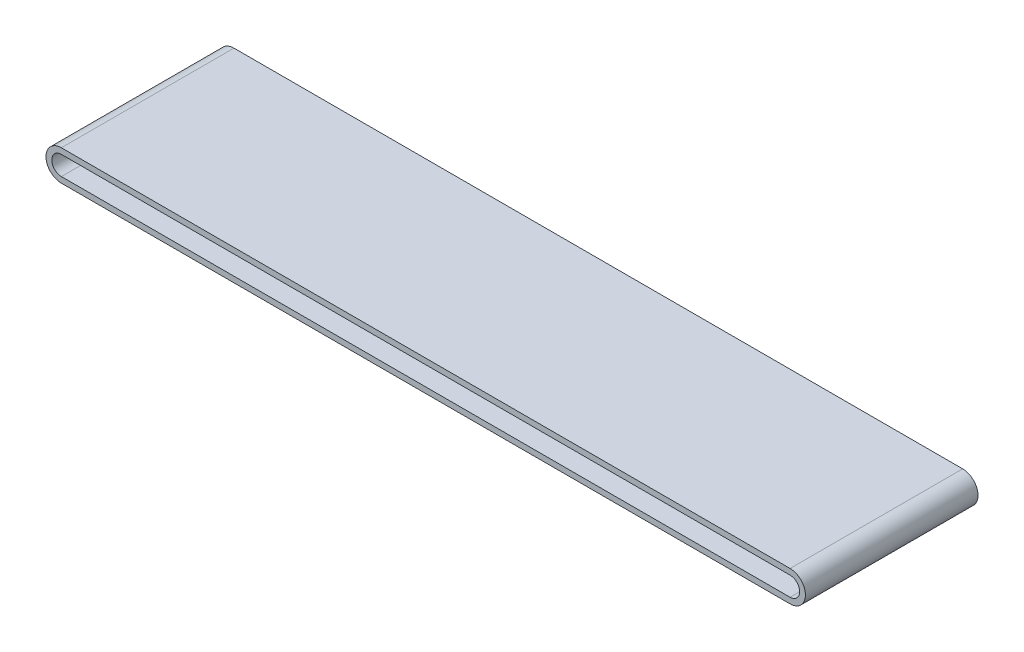
ISO-10303-21;
HEADER;
FILE_DESCRIPTION(('STEP AP214'),'2;1');
FILE_NAME('part.step','',(''),(''),'','','');
FILE_SCHEMA(('AUTOMOTIVE_DESIGN { 1 0 10303 214 1 1 1 1 }'));
ENDSEC;
DATA;
#1=APPLICATION_CONTEXT('core data for automotive mechanical design processes');
#2=APPLICATION_PROTOCOL_DEFINITION('international standard','automotive_design',2000,#1);
#3=PRODUCT_CONTEXT('',#1,'mechanical');
#4=PRODUCT('Part','Part','',(#3));
#5=PRODUCT_RELATED_PRODUCT_CATEGORY('part','',(#4));
#6=PRODUCT_DEFINITION_FORMATION('','',#4);
#7=PRODUCT_DEFINITION_CONTEXT('part definition',#1,'design');
#8=PRODUCT_DEFINITION('design','',#6,#7);
#9=PRODUCT_DEFINITION_SHAPE('','',#8);
#10=(LENGTH_UNIT() NAMED_UNIT(*) SI_UNIT(.MILLI.,.METRE.));
#11=(NAMED_UNIT(*) PLANE_ANGLE_UNIT() SI_UNIT($,.RADIAN.));
#12=(NAMED_UNIT(*) SI_UNIT($,.STERADIAN.) SOLID_ANGLE_UNIT());
#13=UNCERTAINTY_MEASURE_WITH_UNIT(LENGTH_MEASURE(1.E-05),#10,'distance_accuracy_value','');
#14=(GEOMETRIC_REPRESENTATION_CONTEXT(3) GLOBAL_UNCERTAINTY_ASSIGNED_CONTEXT((#13)) GLOBAL_UNIT_ASSIGNED_CONTEXT((#10,
#11,#12)) REPRESENTATION_CONTEXT('',''));
#15=CARTESIAN_POINT('',(0.,0.,0.));
#16=DIRECTION('',(0.,0.,1.));
#17=DIRECTION('',(1.,0.,0.));
#18=AXIS2_PLACEMENT_3D('',#15,#16,#17);
#19=CARTESIAN_POINT('',(2.47808512482686,0.,45.));
#20=DIRECTION('',(0.,0.,-1.));
#21=DIRECTION('',(-1.,0.,0.));
#22=AXIS2_PLACEMENT_3D('',#19,#20,#21);
#23=PLANE('',#22);
#24=CARTESIAN_POINT('',(2.47808512482686,0.,45.));
#25=DIRECTION('',(0.,0.,-1.));
#26=DIRECTION('',(-1.,0.,0.));
#27=AXIS2_PLACEMENT_3D('',#24,#25,#26);
#28=CIRCLE('',#27,8.);
#29=CARTESIAN_POINT('',(2.47808512482686,8.00000000000001,45.));
#30=VERTEX_POINT('',#29);
#31=CARTESIAN_POINT('',(2.47808512482683,-7.99999999999999,45.));
#32=VERTEX_POINT('',#31);
#33=EDGE_CURVE('E164',#30,#32,#28,.F.);
#34=ORIENTED_EDGE('',*,*,#33,.T.);
#35=DIRECTION('',(1.,0.,0.));
#36=VECTOR('',#35,1.);
#37=CARTESIAN_POINT('',(2.47808512482686,-7.99999999999999,45.));
#38=LINE('',#37,#36);
#39=CARTESIAN_POINT('',(382.478085124827,-8.,45.));
#40=VERTEX_POINT('',#39);
#41=EDGE_CURVE('E167',#32,#40,#38,.T.);
#42=ORIENTED_EDGE('',*,*,#41,.T.);
#43=CARTESIAN_POINT('',(382.478085124827,0.,45.));
#44=DIRECTION('',(0.,0.,-1.));
#45=DIRECTION('',(-1.,0.,0.));
#46=AXIS2_PLACEMENT_3D('',#43,#44,#45);
#47=CIRCLE('',#46,8.);
#48=CARTESIAN_POINT('',(382.478085124827,8.,45.));
#49=VERTEX_POINT('',#48);
#50=EDGE_CURVE('E170',#40,#49,#47,.F.);
#51=ORIENTED_EDGE('',*,*,#50,.T.);
#52=DIRECTION('',(-1.,0.,0.));
#53=VECTOR('',#52,1.);
#54=CARTESIAN_POINT('',(2.47808512482686,8.00000000000001,45.));
#55=LINE('',#54,#53);
#56=EDGE_CURVE('E172',#49,#30,#55,.T.);
#57=ORIENTED_EDGE('',*,*,#56,.T.);
#58=EDGE_LOOP('',(#34,#42,#51,#57));
#59=FACE_BOUND('',#58,.T.);
#60=CARTESIAN_POINT('',(2.47808512482686,0.,45.));
#61=DIRECTION('',(0.,0.,1.));
#62=DIRECTION('',(-1.,0.,0.));
#63=AXIS2_PLACEMENT_3D('',#60,#61,#62);
#64=CIRCLE('',#63,5.);
#65=CARTESIAN_POINT('',(2.47808512482686,5.00000000000001,45.));
#66=VERTEX_POINT('',#65);
#67=CARTESIAN_POINT('',(2.47808512482686,-4.99999999999999,45.));
#68=VERTEX_POINT('',#67);
#69=EDGE_CURVE('E128',#66,#68,#64,.T.);
#70=ORIENTED_EDGE('',*,*,#69,.F.);
#71=DIRECTION('',(-1.,0.,0.));
#72=VECTOR('',#71,1.);
#73=CARTESIAN_POINT('',(2.47808512482686,5.00000000000001,45.));
#74=LINE('',#73,#72);
#75=CARTESIAN_POINT('',(382.478085124827,5.,45.));
#76=VERTEX_POINT('',#75);
#77=EDGE_CURVE('E150',#76,#66,#74,.T.);
#78=ORIENTED_EDGE('',*,*,#77,.F.);
#79=CARTESIAN_POINT('',(382.478085124827,0.,45.));
#80=DIRECTION('',(0.,0.,1.));
#81=DIRECTION('',(-1.,0.,0.));
#82=AXIS2_PLACEMENT_3D('',#79,#80,#81);
#83=CIRCLE('',#82,5.);
#84=CARTESIAN_POINT('',(382.478085124827,-5.,45.));
#85=VERTEX_POINT('',#84);
#86=EDGE_CURVE('E148',#85,#76,#83,.T.);
#87=ORIENTED_EDGE('',*,*,#86,.F.);
#88=DIRECTION('',(1.,0.,0.));
#89=VECTOR('',#88,1.);
#90=CARTESIAN_POINT('',(382.478085124827,-5.,45.));
#91=LINE('',#90,#89);
#92=EDGE_CURVE('E136',#68,#85,#91,.T.);
#93=ORIENTED_EDGE('',*,*,#92,.F.);
#94=EDGE_LOOP('',(#70,#78,#87,#93));
#95=FACE_BOUND('',#94,.T.);
#96=ADVANCED_FACE('F63',(#59,#95),#23,.F.);
#97=CARTESIAN_POINT('',(2.47808512482686,0.,-45.));
#98=DIRECTION('',(0.,0.,-1.));
#99=DIRECTION('',(-1.,0.,0.));
#100=AXIS2_PLACEMENT_3D('',#97,#98,#99);
#101=PLANE('',#100);
#102=CARTESIAN_POINT('',(2.47808512482686,0.,-45.));
#103=DIRECTION('',(0.,0.,-1.));
#104=DIRECTION('',(-1.,0.,0.));
#105=AXIS2_PLACEMENT_3D('',#102,#103,#104);
#106=CIRCLE('',#105,8.);
#107=CARTESIAN_POINT('',(2.47808512482686,8.00000000000001,-45.));
#108=VERTEX_POINT('',#107);
#109=CARTESIAN_POINT('',(2.47808512482683,-7.99999999999999,-45.));
#110=VERTEX_POINT('',#109);
#111=EDGE_CURVE('E144',#108,#110,#106,.F.);
#112=ORIENTED_EDGE('',*,*,#111,.F.);
#113=DIRECTION('',(-1.,0.,0.));
#114=VECTOR('',#113,1.);
#115=CARTESIAN_POINT('',(2.47808512482686,8.00000000000001,-45.));
#116=LINE('',#115,#114);
#117=CARTESIAN_POINT('',(382.478085124827,8.,-45.));
#118=VERTEX_POINT('',#117);
#119=EDGE_CURVE('E168',#118,#108,#116,.T.);
#120=ORIENTED_EDGE('',*,*,#119,.F.);
#121=CARTESIAN_POINT('',(382.478085124827,0.,-45.));
#122=DIRECTION('',(0.,0.,-1.));
#123=DIRECTION('',(-1.,0.,0.));
#124=AXIS2_PLACEMENT_3D('',#121,#122,#123);
#125=CIRCLE('',#124,8.);
#126=CARTESIAN_POINT('',(382.478085124827,-8.,-45.));
#127=VERTEX_POINT('',#126);
#128=EDGE_CURVE('E179',#127,#118,#125,.F.);
#129=ORIENTED_EDGE('',*,*,#128,.F.);
#130=DIRECTION('',(1.,0.,0.));
#131=VECTOR('',#130,1.);
#132=CARTESIAN_POINT('',(2.47808512482686,-7.99999999999999,-45.));
#133=LINE('',#132,#131);
#134=EDGE_CURVE('E177',#110,#127,#133,.T.);
#135=ORIENTED_EDGE('',*,*,#134,.F.);
#136=EDGE_LOOP('',(#112,#120,#129,#135));
#137=FACE_BOUND('',#136,.T.);
#138=DIRECTION('',(-1.,0.,0.));
#139=VECTOR('',#138,1.);
#140=CARTESIAN_POINT('',(2.47808512482686,5.00000000000001,-45.));
#141=LINE('',#140,#139);
#142=CARTESIAN_POINT('',(382.478085124827,5.,-45.));
#143=VERTEX_POINT('',#142);
#144=CARTESIAN_POINT('',(2.47808512482686,5.00000000000001,-45.));
#145=VERTEX_POINT('',#144);
#146=EDGE_CURVE('E137',#143,#145,#141,.T.);
#147=ORIENTED_EDGE('',*,*,#146,.T.);
#148=CARTESIAN_POINT('',(2.47808512482686,0.,-45.));
#149=DIRECTION('',(0.,0.,1.));
#150=DIRECTION('',(-1.,0.,0.));
#151=AXIS2_PLACEMENT_3D('',#148,#149,#150);
#152=CIRCLE('',#151,5.);
#153=CARTESIAN_POINT('',(2.47808512482686,-4.99999999999999,-45.));
#154=VERTEX_POINT('',#153);
#155=EDGE_CURVE('E86',#145,#154,#152,.T.);
#156=ORIENTED_EDGE('',*,*,#155,.T.);
#157=DIRECTION('',(1.,0.,0.));
#158=VECTOR('',#157,1.);
#159=CARTESIAN_POINT('',(382.478085124827,-5.,-45.));
#160=LINE('',#159,#158);
#161=CARTESIAN_POINT('',(382.478085124827,-5.,-45.));
#162=VERTEX_POINT('',#161);
#163=EDGE_CURVE('E143',#154,#162,#160,.T.);
#164=ORIENTED_EDGE('',*,*,#163,.T.);
#165=CARTESIAN_POINT('',(382.478085124827,0.,-45.));
#166=DIRECTION('',(0.,0.,1.));
#167=DIRECTION('',(-1.,0.,0.));
#168=AXIS2_PLACEMENT_3D('',#165,#166,#167);
#169=CIRCLE('',#168,5.);
#170=EDGE_CURVE('E156',#162,#143,#169,.T.);
#171=ORIENTED_EDGE('',*,*,#170,.T.);
#172=EDGE_LOOP('',(#147,#156,#164,#171));
#173=FACE_BOUND('',#172,.T.);
#174=ADVANCED_FACE('F197',(#137,#173),#101,.T.);
#175=CARTESIAN_POINT('',(2.47808512482686,0.,45.));
#176=DIRECTION('',(0.,0.,-1.));
#177=DIRECTION('',(-1.,0.,0.));
#178=AXIS2_PLACEMENT_3D('',#175,#176,#177);
#179=CYLINDRICAL_SURFACE('',#178,8.);
#180=ORIENTED_EDGE('',*,*,#111,.T.);
#181=DIRECTION('',(0.,0.,-1.));
#182=VECTOR('',#181,1.);
#183=CARTESIAN_POINT('',(2.47808512482683,-7.99999999999999,45.));
#184=LINE('',#183,#182);
#185=EDGE_CURVE('E12',#32,#110,#184,.T.);
#186=ORIENTED_EDGE('',*,*,#185,.F.);
#187=ORIENTED_EDGE('',*,*,#33,.F.);
#188=DIRECTION('',(0.,0.,-1.));
#189=VECTOR('',#188,1.);
#190=CARTESIAN_POINT('',(2.47808512482686,8.00000000000001,45.));
#191=LINE('',#190,#189);
#192=EDGE_CURVE('E174',#30,#108,#191,.T.);
#193=ORIENTED_EDGE('',*,*,#192,.T.);
#194=EDGE_LOOP('',(#180,#186,#187,#193));
#195=FACE_BOUND('',#194,.T.);
#196=ADVANCED_FACE('F65',(#195),#179,.T.);
#197=CARTESIAN_POINT('',(2.47808512482686,-7.99999999999999,45.));
#198=DIRECTION('',(0.,1.,0.));
#199=DIRECTION('',(-1.,0.,0.));
#200=AXIS2_PLACEMENT_3D('',#197,#198,#199);
#201=PLANE('',#200);
#202=ORIENTED_EDGE('',*,*,#134,.T.);
#203=DIRECTION('',(0.,0.,-1.));
#204=VECTOR('',#203,1.);
#205=CARTESIAN_POINT('',(382.478085124827,-8.,45.));
#206=LINE('',#205,#204);
#207=EDGE_CURVE('E71',#40,#127,#206,.T.);
#208=ORIENTED_EDGE('',*,*,#207,.F.);
#209=ORIENTED_EDGE('',*,*,#41,.F.);
#210=ORIENTED_EDGE('',*,*,#185,.T.);
#211=EDGE_LOOP('',(#202,#208,#209,#210));
#212=FACE_BOUND('',#211,.T.);
#213=ADVANCED_FACE('F207',(#212),#201,.F.);
#214=CARTESIAN_POINT('',(382.478085124827,0.,45.));
#215=DIRECTION('',(0.,0.,-1.));
#216=DIRECTION('',(-1.,0.,0.));
#217=AXIS2_PLACEMENT_3D('',#214,#215,#216);
#218=CYLINDRICAL_SURFACE('',#217,8.);
#219=ORIENTED_EDGE('',*,*,#128,.T.);
#220=DIRECTION('',(0.,0.,-1.));
#221=VECTOR('',#220,1.);
#222=CARTESIAN_POINT('',(382.478085124827,8.,45.));
#223=LINE('',#222,#221);
#224=EDGE_CURVE('E184',#49,#118,#223,.T.);
#225=ORIENTED_EDGE('',*,*,#224,.F.);
#226=ORIENTED_EDGE('',*,*,#50,.F.);
#227=ORIENTED_EDGE('',*,*,#207,.T.);
#228=EDGE_LOOP('',(#219,#225,#226,#227));
#229=FACE_BOUND('',#228,.T.);
#230=ADVANCED_FACE('F191',(#229),#218,.T.);
#231=CARTESIAN_POINT('',(2.47808512482686,8.00000000000001,45.));
#232=DIRECTION('',(0.,-1.,0.));
#233=DIRECTION('',(1.,0.,0.));
#234=AXIS2_PLACEMENT_3D('',#231,#232,#233);
#235=PLANE('',#234);
#236=ORIENTED_EDGE('',*,*,#119,.T.);
#237=ORIENTED_EDGE('',*,*,#192,.F.);
#238=ORIENTED_EDGE('',*,*,#56,.F.);
#239=ORIENTED_EDGE('',*,*,#224,.T.);
#240=EDGE_LOOP('',(#236,#237,#238,#239));
#241=FACE_BOUND('',#240,.T.);
#242=ADVANCED_FACE('F201',(#241),#235,.F.);
#243=CARTESIAN_POINT('',(2.47808512482686,0.,45.));
#244=DIRECTION('',(0.,0.,-1.));
#245=DIRECTION('',(-1.,0.,0.));
#246=AXIS2_PLACEMENT_3D('',#243,#244,#245);
#247=CYLINDRICAL_SURFACE('',#246,5.);
#248=ORIENTED_EDGE('',*,*,#155,.F.);
#249=DIRECTION('',(0.,0.,-1.));
#250=VECTOR('',#249,1.);
#251=CARTESIAN_POINT('',(2.47808512482686,5.00000000000001,45.));
#252=LINE('',#251,#250);
#253=EDGE_CURVE('E132',#66,#145,#252,.T.);
#254=ORIENTED_EDGE('',*,*,#253,.F.);
#255=ORIENTED_EDGE('',*,*,#69,.T.);
#256=DIRECTION('',(0.,0.,-1.));
#257=VECTOR('',#256,1.);
#258=CARTESIAN_POINT('',(2.47808512482686,-4.99999999999999,45.));
#259=LINE('',#258,#257);
#260=EDGE_CURVE('E131',#68,#154,#259,.T.);
#261=ORIENTED_EDGE('',*,*,#260,.T.);
#262=EDGE_LOOP('',(#248,#254,#255,#261));
#263=FACE_BOUND('',#262,.T.);
#264=ADVANCED_FACE('F130',(#263),#247,.F.);
#265=CARTESIAN_POINT('',(382.478085124827,-5.,45.));
#266=DIRECTION('',(0.,1.,0.));
#267=DIRECTION('',(-1.,0.,0.));
#268=AXIS2_PLACEMENT_3D('',#265,#266,#267);
#269=PLANE('',#268);
#270=ORIENTED_EDGE('',*,*,#163,.F.);
#271=ORIENTED_EDGE('',*,*,#260,.F.);
#272=ORIENTED_EDGE('',*,*,#92,.T.);
#273=DIRECTION('',(0.,0.,-1.));
#274=VECTOR('',#273,1.);
#275=CARTESIAN_POINT('',(382.478085124827,-5.,45.));
#276=LINE('',#275,#274);
#277=EDGE_CURVE('E145',#85,#162,#276,.T.);
#278=ORIENTED_EDGE('',*,*,#277,.T.);
#279=EDGE_LOOP('',(#270,#271,#272,#278));
#280=FACE_BOUND('',#279,.T.);
#281=ADVANCED_FACE('F140',(#280),#269,.T.);
#282=CARTESIAN_POINT('',(382.478085124827,0.,45.));
#283=DIRECTION('',(0.,0.,-1.));
#284=DIRECTION('',(-1.,0.,0.));
#285=AXIS2_PLACEMENT_3D('',#282,#283,#284);
#286=CYLINDRICAL_SURFACE('',#285,5.);
#287=ORIENTED_EDGE('',*,*,#170,.F.);
#288=ORIENTED_EDGE('',*,*,#277,.F.);
#289=ORIENTED_EDGE('',*,*,#86,.T.);
#290=DIRECTION('',(0.,0.,-1.));
#291=VECTOR('',#290,1.);
#292=CARTESIAN_POINT('',(382.478085124827,5.,45.));
#293=LINE('',#292,#291);
#294=EDGE_CURVE('E78',#76,#143,#293,.T.);
#295=ORIENTED_EDGE('',*,*,#294,.T.);
#296=EDGE_LOOP('',(#287,#288,#289,#295));
#297=FACE_BOUND('',#296,.T.);
#298=ADVANCED_FACE('F230',(#297),#286,.F.);
#299=CARTESIAN_POINT('',(2.47808512482686,5.00000000000001,45.));
#300=DIRECTION('',(0.,-1.,0.));
#301=DIRECTION('',(1.,0.,0.));
#302=AXIS2_PLACEMENT_3D('',#299,#300,#301);
#303=PLANE('',#302);
#304=ORIENTED_EDGE('',*,*,#146,.F.);
#305=ORIENTED_EDGE('',*,*,#294,.F.);
#306=ORIENTED_EDGE('',*,*,#77,.T.);
#307=ORIENTED_EDGE('',*,*,#253,.T.);
#308=EDGE_LOOP('',(#304,#305,#306,#307));
#309=FACE_BOUND('',#308,.T.);
#310=ADVANCED_FACE('F234',(#309),#303,.T.);
#311=CLOSED_SHELL('',(#96,#174,#196,#213,#230,#242,#264,#281,#298,#310));
#312=MANIFOLD_SOLID_BREP('B2',#311);
#313=ADVANCED_BREP_SHAPE_REPRESENTATION('',(#18,#312),#14);
#314=SHAPE_DEFINITION_REPRESENTATION(#9,#313);
ENDSEC;
END-ISO-10303-21;
